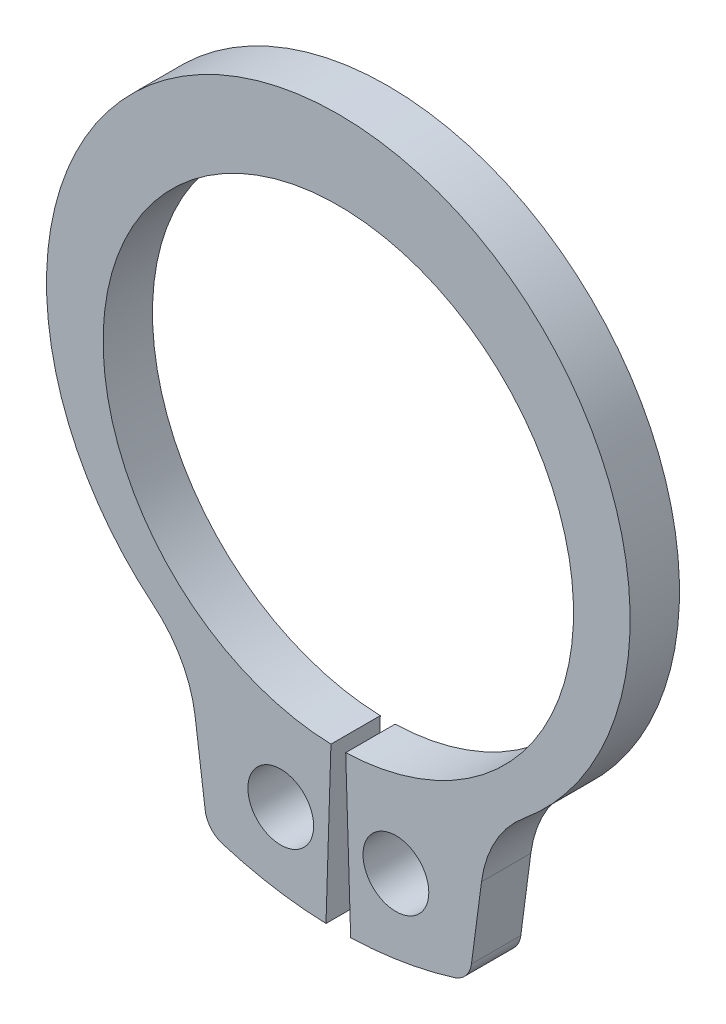
ISO-10303-21;
HEADER;
FILE_DESCRIPTION(('STEP AP214'),'2;1');
FILE_NAME('part.step','',(''),(''),'','','');
FILE_SCHEMA(('AUTOMOTIVE_DESIGN { 1 0 10303 214 1 1 1 1 }'));
ENDSEC;
DATA;
#1=APPLICATION_CONTEXT('core data for automotive mechanical design processes');
#2=APPLICATION_PROTOCOL_DEFINITION('international standard','automotive_design',2000,#1);
#3=PRODUCT_CONTEXT('',#1,'mechanical');
#4=PRODUCT('Part','Part','',(#3));
#5=PRODUCT_RELATED_PRODUCT_CATEGORY('part','',(#4));
#6=PRODUCT_DEFINITION_FORMATION('','',#4);
#7=PRODUCT_DEFINITION_CONTEXT('part definition',#1,'design');
#8=PRODUCT_DEFINITION('design','',#6,#7);
#9=PRODUCT_DEFINITION_SHAPE('','',#8);
#10=(LENGTH_UNIT() NAMED_UNIT(*) SI_UNIT(.MILLI.,.METRE.));
#11=(NAMED_UNIT(*) PLANE_ANGLE_UNIT() SI_UNIT($,.RADIAN.));
#12=(NAMED_UNIT(*) SI_UNIT($,.STERADIAN.) SOLID_ANGLE_UNIT());
#13=UNCERTAINTY_MEASURE_WITH_UNIT(LENGTH_MEASURE(1.E-05),#10,'distance_accuracy_value','');
#14=(GEOMETRIC_REPRESENTATION_CONTEXT(3) GLOBAL_UNCERTAINTY_ASSIGNED_CONTEXT((#13)) GLOBAL_UNIT_ASSIGNED_CONTEXT((#10,
#11,#12)) REPRESENTATION_CONTEXT('',''));
#15=CARTESIAN_POINT('',(0.,0.,0.));
#16=DIRECTION('',(0.,0.,1.));
#17=DIRECTION('',(1.,0.,0.));
#18=AXIS2_PLACEMENT_3D('',#15,#16,#17);
#19=CARTESIAN_POINT('',(0.,0.,-1.5));
#20=DIRECTION('',(0.,0.,1.));
#21=DIRECTION('',(1.,0.,0.));
#22=AXIS2_PLACEMENT_3D('',#19,#20,#21);
#23=CYLINDRICAL_SURFACE('',#22,7.15000000000001);
#24=CARTESIAN_POINT('',(0.,0.,0.));
#25=DIRECTION('',(0.,0.,-1.));
#26=DIRECTION('',(1.,0.,0.));
#27=AXIS2_PLACEMENT_3D('',#24,#25,#26);
#28=CIRCLE('',#27,7.15000000000001);
#29=CARTESIAN_POINT('',(-0.224372384937239,-7.14647864566023,0.));
#30=VERTEX_POINT('',#29);
#31=CARTESIAN_POINT('',(0.224372384937239,-7.14647864566023,0.));
#32=VERTEX_POINT('',#31);
#33=EDGE_CURVE('E155',#30,#32,#28,.T.);
#34=ORIENTED_EDGE('',*,*,#33,.F.);
#35=DIRECTION('',(0.,0.,1.));
#36=VECTOR('',#35,1.);
#37=CARTESIAN_POINT('',(-0.224372384937239,-7.14647864566023,-1.5));
#38=LINE('',#37,#36);
#39=CARTESIAN_POINT('',(-0.224372384937239,-7.14647864566023,-1.5));
#40=VERTEX_POINT('',#39);
#41=EDGE_CURVE('E11',#40,#30,#38,.T.);
#42=ORIENTED_EDGE('',*,*,#41,.F.);
#43=CARTESIAN_POINT('',(0.,0.,-1.5));
#44=DIRECTION('',(0.,0.,-1.));
#45=DIRECTION('',(1.,0.,0.));
#46=AXIS2_PLACEMENT_3D('',#43,#44,#45);
#47=CIRCLE('',#46,7.15000000000001);
#48=CARTESIAN_POINT('',(0.224372384937239,-7.14647864566023,-1.5));
#49=VERTEX_POINT('',#48);
#50=EDGE_CURVE('E188',#40,#49,#47,.T.);
#51=ORIENTED_EDGE('',*,*,#50,.T.);
#52=DIRECTION('',(0.,0.,1.));
#53=VECTOR('',#52,1.);
#54=CARTESIAN_POINT('',(0.224372384937239,-7.14647864566023,-1.5));
#55=LINE('',#54,#53);
#56=EDGE_CURVE('E37',#49,#32,#55,.T.);
#57=ORIENTED_EDGE('',*,*,#56,.T.);
#58=EDGE_LOOP('',(#34,#42,#51,#57));
#59=FACE_BOUND('',#58,.T.);
#60=ADVANCED_FACE('F34',(#59),#23,.F.);
#61=CARTESIAN_POINT('',(-0.224372384937239,-7.14647864566023,-1.5));
#62=DIRECTION('',(0.999507502889542,-0.0313807531380752,0.));
#63=DIRECTION('',(0.0313807531380752,0.999507502889542,0.));
#64=AXIS2_PLACEMENT_3D('',#61,#62,#63);
#65=PLANE('',#64);
#66=DIRECTION('',(0.0313807531380752,0.999507502889542,0.));
#67=VECTOR('',#66,1.);
#68=CARTESIAN_POINT('',(-0.224372384937239,-7.14647864566023,0.));
#69=LINE('',#68,#67);
#70=CARTESIAN_POINT('',(-0.375,-11.94411465953,0.));
#71=VERTEX_POINT('',#70);
#72=EDGE_CURVE('E186',#71,#30,#69,.T.);
#73=ORIENTED_EDGE('',*,*,#72,.F.);
#74=DIRECTION('',(0.,0.,1.));
#75=VECTOR('',#74,1.);
#76=CARTESIAN_POINT('',(-0.375,-11.94411465953,-1.5));
#77=LINE('',#76,#75);
#78=CARTESIAN_POINT('',(-0.375,-11.94411465953,-1.5));
#79=VERTEX_POINT('',#78);
#80=EDGE_CURVE('E43',#79,#71,#77,.T.);
#81=ORIENTED_EDGE('',*,*,#80,.F.);
#82=DIRECTION('',(0.0313807531380752,0.999507502889542,0.));
#83=VECTOR('',#82,1.);
#84=CARTESIAN_POINT('',(-0.224372384937239,-7.14647864566023,-1.5));
#85=LINE('',#84,#83);
#86=EDGE_CURVE('E145',#79,#40,#85,.T.);
#87=ORIENTED_EDGE('',*,*,#86,.T.);
#88=ORIENTED_EDGE('',*,*,#41,.T.);
#89=EDGE_LOOP('',(#73,#81,#87,#88));
#90=FACE_BOUND('',#89,.T.);
#91=ADVANCED_FACE('F208',(#90),#65,.T.);
#92=CARTESIAN_POINT('',(0.,0.,-1.5));
#93=DIRECTION('',(0.,0.,1.));
#94=DIRECTION('',(1.,0.,0.));
#95=AXIS2_PLACEMENT_3D('',#92,#93,#94);
#96=CYLINDRICAL_SURFACE('',#95,11.95);
#97=CARTESIAN_POINT('',(0.,0.,0.));
#98=DIRECTION('',(0.,0.,1.));
#99=DIRECTION('',(1.,0.,0.));
#100=AXIS2_PLACEMENT_3D('',#97,#98,#99);
#101=CIRCLE('',#100,11.95);
#102=CARTESIAN_POINT('',(-3.52441051131401,-11.4184513200232,0.));
#103=VERTEX_POINT('',#102);
#104=EDGE_CURVE('E132',#103,#71,#101,.T.);
#105=ORIENTED_EDGE('',*,*,#104,.F.);
#106=DIRECTION('',(0.,0.,1.));
#107=VECTOR('',#106,1.);
#108=CARTESIAN_POINT('',(-3.52441051131401,-11.4184513200232,-1.5));
#109=LINE('',#108,#107);
#110=CARTESIAN_POINT('',(-3.52441051131401,-11.4184513200232,-1.5));
#111=VERTEX_POINT('',#110);
#112=EDGE_CURVE('E127',#111,#103,#109,.T.);
#113=ORIENTED_EDGE('',*,*,#112,.F.);
#114=CARTESIAN_POINT('',(0.,0.,-1.5));
#115=DIRECTION('',(0.,0.,1.));
#116=DIRECTION('',(1.,0.,0.));
#117=AXIS2_PLACEMENT_3D('',#114,#115,#116);
#118=CIRCLE('',#117,11.95);
#119=EDGE_CURVE('E130',#111,#79,#118,.T.);
#120=ORIENTED_EDGE('',*,*,#119,.T.);
#121=ORIENTED_EDGE('',*,*,#80,.T.);
#122=EDGE_LOOP('',(#105,#113,#120,#121));
#123=FACE_BOUND('',#122,.T.);
#124=ADVANCED_FACE('F129',(#123),#96,.T.);
#125=CARTESIAN_POINT('',(-3.30321319888844,-10.7018121158376,-1.5));
#126=DIRECTION('',(0.,0.,1.));
#127=DIRECTION('',(1.,0.,0.));
#128=AXIS2_PLACEMENT_3D('',#125,#126,#127);
#129=CYLINDRICAL_SURFACE('',#128,0.749999999999998);
#130=CARTESIAN_POINT('',(-3.30321319888844,-10.7018121158376,0.));
#131=DIRECTION('',(0.,0.,1.));
#132=DIRECTION('',(1.,0.,0.));
#133=AXIS2_PLACEMENT_3D('',#130,#131,#132);
#134=CIRCLE('',#133,0.749999999999998);
#135=CARTESIAN_POINT('',(-4.04679684491879,-10.7997067600027,0.));
#136=VERTEX_POINT('',#135);
#137=EDGE_CURVE('E183',#136,#103,#134,.T.);
#138=ORIENTED_EDGE('',*,*,#137,.F.);
#139=DIRECTION('',(0.,0.,1.));
#140=VECTOR('',#139,1.);
#141=CARTESIAN_POINT('',(-4.04679684491879,-10.7997067600027,-1.5));
#142=LINE('',#141,#140);
#143=CARTESIAN_POINT('',(-4.04679684491879,-10.7997067600027,-1.5));
#144=VERTEX_POINT('',#143);
#145=EDGE_CURVE('E137',#144,#136,#142,.T.);
#146=ORIENTED_EDGE('',*,*,#145,.F.);
#147=CARTESIAN_POINT('',(-3.30321319888844,-10.7018121158376,-1.5));
#148=DIRECTION('',(0.,0.,1.));
#149=DIRECTION('',(1.,0.,0.));
#150=AXIS2_PLACEMENT_3D('',#147,#148,#149);
#151=CIRCLE('',#150,0.749999999999998);
#152=EDGE_CURVE('E143',#144,#111,#151,.T.);
#153=ORIENTED_EDGE('',*,*,#152,.T.);
#154=ORIENTED_EDGE('',*,*,#112,.T.);
#155=EDGE_LOOP('',(#138,#146,#153,#154));
#156=FACE_BOUND('',#155,.T.);
#157=ADVANCED_FACE('F147',(#156),#129,.T.);
#158=CARTESIAN_POINT('',(-4.35208395412913,-8.48082094465635,-1.5));
#159=DIRECTION('',(-0.99144486137381,-0.130526192220055,0.));
#160=DIRECTION('',(0.130526192220055,-0.99144486137381,0.));
#161=AXIS2_PLACEMENT_3D('',#158,#159,#160);
#162=PLANE('',#161);
#163=DIRECTION('',(0.130526192220055,-0.99144486137381,0.));
#164=VECTOR('',#163,1.);
#165=CARTESIAN_POINT('',(-4.35208395412913,-8.48082094465635,0.));
#166=LINE('',#165,#164);
#167=CARTESIAN_POINT('',(-4.35208395412913,-8.48082094465635,0.));
#168=VERTEX_POINT('',#167);
#169=EDGE_CURVE('E180',#168,#136,#166,.T.);
#170=ORIENTED_EDGE('',*,*,#169,.F.);
#171=DIRECTION('',(0.,0.,1.));
#172=VECTOR('',#171,1.);
#173=CARTESIAN_POINT('',(-4.35208395412913,-8.48082094465635,-1.5));
#174=LINE('',#173,#172);
#175=CARTESIAN_POINT('',(-4.35208395412913,-8.48082094465635,-1.5));
#176=VERTEX_POINT('',#175);
#177=EDGE_CURVE('E192',#176,#168,#174,.T.);
#178=ORIENTED_EDGE('',*,*,#177,.F.);
#179=DIRECTION('',(0.130526192220055,-0.99144486137381,0.));
#180=VECTOR('',#179,1.);
#181=CARTESIAN_POINT('',(-4.35208395412913,-8.48082094465635,-1.5));
#182=LINE('',#181,#180);
#183=EDGE_CURVE('E148',#176,#144,#182,.T.);
#184=ORIENTED_EDGE('',*,*,#183,.T.);
#185=ORIENTED_EDGE('',*,*,#145,.T.);
#186=EDGE_LOOP('',(#170,#178,#184,#185));
#187=FACE_BOUND('',#186,.T.);
#188=ADVANCED_FACE('F221',(#187),#162,.T.);
#189=CARTESIAN_POINT('',(-7.91801185207422,-8.95028425863739,-1.5));
#190=DIRECTION('',(0.,0.,1.));
#191=DIRECTION('',(1.,0.,0.));
#192=AXIS2_PLACEMENT_3D('',#189,#190,#191);
#193=CYLINDRICAL_SURFACE('',#192,3.59669814920812);
#194=CARTESIAN_POINT('',(-7.91801185207422,-8.95028425863739,0.));
#195=DIRECTION('',(0.,0.,-1.));
#196=DIRECTION('',(1.,0.,0.));
#197=AXIS2_PLACEMENT_3D('',#194,#195,#196);
#198=CIRCLE('',#197,3.59669814920812);
#199=CARTESIAN_POINT('',(-5.63370766568188,-6.17212084361883,0.));
#200=VERTEX_POINT('',#199);
#201=EDGE_CURVE('E177',#200,#168,#198,.T.);
#202=ORIENTED_EDGE('',*,*,#201,.F.);
#203=DIRECTION('',(0.,0.,1.));
#204=VECTOR('',#203,1.);
#205=CARTESIAN_POINT('',(-5.63370766568188,-6.17212084361883,-1.5));
#206=LINE('',#205,#204);
#207=CARTESIAN_POINT('',(-5.63370766568188,-6.17212084361883,-1.5));
#208=VERTEX_POINT('',#207);
#209=EDGE_CURVE('E194',#208,#200,#206,.T.);
#210=ORIENTED_EDGE('',*,*,#209,.F.);
#211=CARTESIAN_POINT('',(-7.91801185207422,-8.95028425863739,-1.5));
#212=DIRECTION('',(0.,0.,-1.));
#213=DIRECTION('',(1.,0.,0.));
#214=AXIS2_PLACEMENT_3D('',#211,#212,#213);
#215=CIRCLE('',#214,3.59669814920812);
#216=EDGE_CURVE('E150',#208,#176,#215,.T.);
#217=ORIENTED_EDGE('',*,*,#216,.T.);
#218=ORIENTED_EDGE('',*,*,#177,.T.);
#219=EDGE_LOOP('',(#202,#210,#217,#218));
#220=FACE_BOUND('',#219,.T.);
#221=ADVANCED_FACE('F224',(#220),#193,.F.);
#222=CARTESIAN_POINT('',(0.,0.679576325673524,-1.5));
#223=DIRECTION('',(0.,0.,1.));
#224=DIRECTION('',(1.,0.,0.));
#225=AXIS2_PLACEMENT_3D('',#222,#223,#224);
#226=CYLINDRICAL_SURFACE('',#225,8.87042367432648);
#227=CARTESIAN_POINT('',(0.,0.679576325673524,0.));
#228=DIRECTION('',(0.,0.,1.));
#229=DIRECTION('',(1.,0.,0.));
#230=AXIS2_PLACEMENT_3D('',#227,#228,#229);
#231=CIRCLE('',#230,8.87042367432648);
#232=CARTESIAN_POINT('',(5.63370766568188,-6.17212084361883,0.));
#233=VERTEX_POINT('',#232);
#234=EDGE_CURVE('E174',#233,#200,#231,.T.);
#235=ORIENTED_EDGE('',*,*,#234,.F.);
#236=DIRECTION('',(0.,0.,1.));
#237=VECTOR('',#236,1.);
#238=CARTESIAN_POINT('',(5.63370766568188,-6.17212084361883,-1.5));
#239=LINE('',#238,#237);
#240=CARTESIAN_POINT('',(5.63370766568188,-6.17212084361883,-1.5));
#241=VERTEX_POINT('',#240);
#242=EDGE_CURVE('E196',#241,#233,#239,.T.);
#243=ORIENTED_EDGE('',*,*,#242,.F.);
#244=CARTESIAN_POINT('',(0.,0.679576325673524,-1.5));
#245=DIRECTION('',(0.,0.,1.));
#246=DIRECTION('',(1.,0.,0.));
#247=AXIS2_PLACEMENT_3D('',#244,#245,#246);
#248=CIRCLE('',#247,8.87042367432648);
#249=EDGE_CURVE('E298',#241,#208,#248,.T.);
#250=ORIENTED_EDGE('',*,*,#249,.T.);
#251=ORIENTED_EDGE('',*,*,#209,.T.);
#252=EDGE_LOOP('',(#235,#243,#250,#251));
#253=FACE_BOUND('',#252,.T.);
#254=ADVANCED_FACE('F228',(#253),#226,.T.);
#255=CARTESIAN_POINT('',(7.91801185207422,-8.95028425863739,-1.5));
#256=DIRECTION('',(0.,0.,1.));
#257=DIRECTION('',(1.,0.,0.));
#258=AXIS2_PLACEMENT_3D('',#255,#256,#257);
#259=CYLINDRICAL_SURFACE('',#258,3.59669814920812);
#260=CARTESIAN_POINT('',(7.91801185207422,-8.95028425863739,0.));
#261=DIRECTION('',(0.,0.,-1.));
#262=DIRECTION('',(1.,0.,0.));
#263=AXIS2_PLACEMENT_3D('',#260,#261,#262);
#264=CIRCLE('',#263,3.59669814920812);
#265=CARTESIAN_POINT('',(4.35208395412913,-8.48082094465635,0.));
#266=VERTEX_POINT('',#265);
#267=EDGE_CURVE('E171',#266,#233,#264,.T.);
#268=ORIENTED_EDGE('',*,*,#267,.F.);
#269=DIRECTION('',(0.,0.,1.));
#270=VECTOR('',#269,1.);
#271=CARTESIAN_POINT('',(4.35208395412913,-8.48082094465635,-1.5));
#272=LINE('',#271,#270);
#273=CARTESIAN_POINT('',(4.35208395412913,-8.48082094465635,-1.5));
#274=VERTEX_POINT('',#273);
#275=EDGE_CURVE('E198',#274,#266,#272,.T.);
#276=ORIENTED_EDGE('',*,*,#275,.F.);
#277=CARTESIAN_POINT('',(7.91801185207422,-8.95028425863739,-1.5));
#278=DIRECTION('',(0.,0.,-1.));
#279=DIRECTION('',(1.,0.,0.));
#280=AXIS2_PLACEMENT_3D('',#277,#278,#279);
#281=CIRCLE('',#280,3.59669814920812);
#282=EDGE_CURVE('E295',#274,#241,#281,.T.);
#283=ORIENTED_EDGE('',*,*,#282,.T.);
#284=ORIENTED_EDGE('',*,*,#242,.T.);
#285=EDGE_LOOP('',(#268,#276,#283,#284));
#286=FACE_BOUND('',#285,.T.);
#287=ADVANCED_FACE('F232',(#286),#259,.F.);
#288=CARTESIAN_POINT('',(4.35208395412913,-8.48082094465635,-1.5));
#289=DIRECTION('',(0.99144486137381,-0.130526192220055,0.));
#290=DIRECTION('',(0.130526192220055,0.99144486137381,0.));
#291=AXIS2_PLACEMENT_3D('',#288,#289,#290);
#292=PLANE('',#291);
#293=DIRECTION('',(0.130526192220055,0.99144486137381,0.));
#294=VECTOR('',#293,1.);
#295=CARTESIAN_POINT('',(4.35208395412913,-8.48082094465635,0.));
#296=LINE('',#295,#294);
#297=CARTESIAN_POINT('',(4.04679684491879,-10.7997067600027,0.));
#298=VERTEX_POINT('',#297);
#299=EDGE_CURVE('E168',#298,#266,#296,.T.);
#300=ORIENTED_EDGE('',*,*,#299,.F.);
#301=DIRECTION('',(0.,0.,1.));
#302=VECTOR('',#301,1.);
#303=CARTESIAN_POINT('',(4.04679684491879,-10.7997067600027,-1.5));
#304=LINE('',#303,#302);
#305=CARTESIAN_POINT('',(4.04679684491879,-10.7997067600027,-1.5));
#306=VERTEX_POINT('',#305);
#307=EDGE_CURVE('E200',#306,#298,#304,.T.);
#308=ORIENTED_EDGE('',*,*,#307,.F.);
#309=DIRECTION('',(0.130526192220055,0.99144486137381,0.));
#310=VECTOR('',#309,1.);
#311=CARTESIAN_POINT('',(4.35208395412913,-8.48082094465635,-1.5));
#312=LINE('',#311,#310);
#313=EDGE_CURVE('E292',#306,#274,#312,.T.);
#314=ORIENTED_EDGE('',*,*,#313,.T.);
#315=ORIENTED_EDGE('',*,*,#275,.T.);
#316=EDGE_LOOP('',(#300,#308,#314,#315));
#317=FACE_BOUND('',#316,.T.);
#318=ADVANCED_FACE('F236',(#317),#292,.T.);
#319=CARTESIAN_POINT('',(3.30321319888844,-10.7018121158376,-1.5));
#320=DIRECTION('',(0.,0.,1.));
#321=DIRECTION('',(1.,0.,0.));
#322=AXIS2_PLACEMENT_3D('',#319,#320,#321);
#323=CYLINDRICAL_SURFACE('',#322,0.749999999999998);
#324=CARTESIAN_POINT('',(3.30321319888844,-10.7018121158376,0.));
#325=DIRECTION('',(0.,0.,1.));
#326=DIRECTION('',(-1.,0.,0.));
#327=AXIS2_PLACEMENT_3D('',#324,#325,#326);
#328=CIRCLE('',#327,0.749999999999998);
#329=CARTESIAN_POINT('',(3.524410511314,-11.4184513200232,0.));
#330=VERTEX_POINT('',#329);
#331=EDGE_CURVE('E165',#330,#298,#328,.T.);
#332=ORIENTED_EDGE('',*,*,#331,.F.);
#333=DIRECTION('',(0.,0.,1.));
#334=VECTOR('',#333,1.);
#335=CARTESIAN_POINT('',(3.524410511314,-11.4184513200232,-1.5));
#336=LINE('',#335,#334);
#337=CARTESIAN_POINT('',(3.524410511314,-11.4184513200232,-1.5));
#338=VERTEX_POINT('',#337);
#339=EDGE_CURVE('E202',#338,#330,#336,.T.);
#340=ORIENTED_EDGE('',*,*,#339,.F.);
#341=CARTESIAN_POINT('',(3.30321319888844,-10.7018121158376,-1.5));
#342=DIRECTION('',(0.,0.,1.));
#343=DIRECTION('',(-1.,0.,0.));
#344=AXIS2_PLACEMENT_3D('',#341,#342,#343);
#345=CIRCLE('',#344,0.749999999999998);
#346=EDGE_CURVE('E289',#338,#306,#345,.T.);
#347=ORIENTED_EDGE('',*,*,#346,.T.);
#348=ORIENTED_EDGE('',*,*,#307,.T.);
#349=EDGE_LOOP('',(#332,#340,#347,#348));
#350=FACE_BOUND('',#349,.T.);
#351=ADVANCED_FACE('F240',(#350),#323,.T.);
#352=CARTESIAN_POINT('',(0.,0.,-1.5));
#353=DIRECTION('',(0.,0.,1.));
#354=DIRECTION('',(1.,0.,0.));
#355=AXIS2_PLACEMENT_3D('',#352,#353,#354);
#356=CYLINDRICAL_SURFACE('',#355,11.95);
#357=CARTESIAN_POINT('',(0.,0.,0.));
#358=DIRECTION('',(0.,0.,1.));
#359=DIRECTION('',(1.,0.,0.));
#360=AXIS2_PLACEMENT_3D('',#357,#358,#359);
#361=CIRCLE('',#360,11.95);
#362=CARTESIAN_POINT('',(0.374999999999998,-11.94411465953,0.));
#363=VERTEX_POINT('',#362);
#364=EDGE_CURVE('E162',#363,#330,#361,.T.);
#365=ORIENTED_EDGE('',*,*,#364,.F.);
#366=DIRECTION('',(0.,0.,1.));
#367=VECTOR('',#366,1.);
#368=CARTESIAN_POINT('',(0.374999999999998,-11.94411465953,-1.5));
#369=LINE('',#368,#367);
#370=CARTESIAN_POINT('',(0.374999999999998,-11.94411465953,-1.5));
#371=VERTEX_POINT('',#370);
#372=EDGE_CURVE('E203',#371,#363,#369,.T.);
#373=ORIENTED_EDGE('',*,*,#372,.F.);
#374=CARTESIAN_POINT('',(0.,0.,-1.5));
#375=DIRECTION('',(0.,0.,1.));
#376=DIRECTION('',(1.,0.,0.));
#377=AXIS2_PLACEMENT_3D('',#374,#375,#376);
#378=CIRCLE('',#377,11.95);
#379=EDGE_CURVE('E286',#371,#338,#378,.T.);
#380=ORIENTED_EDGE('',*,*,#379,.T.);
#381=ORIENTED_EDGE('',*,*,#339,.T.);
#382=EDGE_LOOP('',(#365,#373,#380,#381));
#383=FACE_BOUND('',#382,.T.);
#384=ADVANCED_FACE('F244',(#383),#356,.T.);
#385=CARTESIAN_POINT('',(0.224372384937239,-7.14647864566023,-1.5));
#386=DIRECTION('',(-0.999507502889542,-0.0313807531380752,0.));
#387=DIRECTION('',(0.0313807531380752,-0.999507502889542,0.));
#388=AXIS2_PLACEMENT_3D('',#385,#386,#387);
#389=PLANE('',#388);
#390=DIRECTION('',(0.0313807531380752,-0.999507502889542,0.));
#391=VECTOR('',#390,1.);
#392=CARTESIAN_POINT('',(0.224372384937239,-7.14647864566023,0.));
#393=LINE('',#392,#391);
#394=EDGE_CURVE('E158',#32,#363,#393,.T.);
#395=ORIENTED_EDGE('',*,*,#394,.F.);
#396=ORIENTED_EDGE('',*,*,#56,.F.);
#397=DIRECTION('',(0.0313807531380752,-0.999507502889542,0.));
#398=VECTOR('',#397,1.);
#399=CARTESIAN_POINT('',(0.224372384937239,-7.14647864566023,-1.5));
#400=LINE('',#399,#398);
#401=EDGE_CURVE('E284',#49,#371,#400,.T.);
#402=ORIENTED_EDGE('',*,*,#401,.T.);
#403=ORIENTED_EDGE('',*,*,#372,.T.);
#404=EDGE_LOOP('',(#395,#396,#402,#403));
#405=FACE_BOUND('',#404,.T.);
#406=ADVANCED_FACE('F205',(#405),#389,.T.);
#407=CARTESIAN_POINT('',(0.,0.,-1.5));
#408=DIRECTION('',(0.,0.,1.));
#409=DIRECTION('',(1.,0.,0.));
#410=AXIS2_PLACEMENT_3D('',#407,#408,#409);
#411=PLANE('',#410);
#412=CARTESIAN_POINT('',(-1.75,-9.56624926499409,-1.5));
#413=DIRECTION('',(0.,0.,1.));
#414=DIRECTION('',(1.,0.,0.));
#415=AXIS2_PLACEMENT_3D('',#412,#413,#414);
#416=CIRCLE('',#415,1.);
#417=CARTESIAN_POINT('',(-0.75,-9.56624926499409,-1.5));
#418=VERTEX_POINT('',#417);
#419=EDGE_CURVE('E271',#418,#418,#416,.T.);
#420=ORIENTED_EDGE('',*,*,#419,.T.);
#421=EDGE_LOOP('',(#420));
#422=FACE_BOUND('',#421,.T.);
#423=CARTESIAN_POINT('',(1.75,-9.56624926499409,-1.5));
#424=DIRECTION('',(0.,0.,1.));
#425=DIRECTION('',(1.,0.,0.));
#426=AXIS2_PLACEMENT_3D('',#423,#424,#425);
#427=CIRCLE('',#426,1.);
#428=CARTESIAN_POINT('',(2.75,-9.56624926499409,-1.5));
#429=VERTEX_POINT('',#428);
#430=EDGE_CURVE('E159',#429,#429,#427,.T.);
#431=ORIENTED_EDGE('',*,*,#430,.T.);
#432=EDGE_LOOP('',(#431));
#433=FACE_BOUND('',#432,.T.);
#434=ORIENTED_EDGE('',*,*,#50,.F.);
#435=ORIENTED_EDGE('',*,*,#86,.F.);
#436=ORIENTED_EDGE('',*,*,#119,.F.);
#437=ORIENTED_EDGE('',*,*,#152,.F.);
#438=ORIENTED_EDGE('',*,*,#183,.F.);
#439=ORIENTED_EDGE('',*,*,#216,.F.);
#440=ORIENTED_EDGE('',*,*,#249,.F.);
#441=ORIENTED_EDGE('',*,*,#282,.F.);
#442=ORIENTED_EDGE('',*,*,#313,.F.);
#443=ORIENTED_EDGE('',*,*,#346,.F.);
#444=ORIENTED_EDGE('',*,*,#379,.F.);
#445=ORIENTED_EDGE('',*,*,#401,.F.);
#446=EDGE_LOOP('',(#434,#435,#436,#437,#438,#439,#440,#441,#442,#443,#444,#445));
#447=FACE_BOUND('',#446,.T.);
#448=ADVANCED_FACE('F141',(#422,#433,#447),#411,.F.);
#449=CARTESIAN_POINT('',(0.,0.,0.));
#450=DIRECTION('',(0.,0.,1.));
#451=DIRECTION('',(1.,0.,0.));
#452=AXIS2_PLACEMENT_3D('',#449,#450,#451);
#453=PLANE('',#452);
#454=CARTESIAN_POINT('',(-1.75,-9.56624926499409,0.));
#455=DIRECTION('',(0.,0.,1.));
#456=DIRECTION('',(1.,0.,0.));
#457=AXIS2_PLACEMENT_3D('',#454,#455,#456);
#458=CIRCLE('',#457,1.);
#459=CARTESIAN_POINT('',(-0.75,-9.56624926499409,0.));
#460=VERTEX_POINT('',#459);
#461=EDGE_CURVE('E274',#460,#460,#458,.T.);
#462=ORIENTED_EDGE('',*,*,#461,.F.);
#463=EDGE_LOOP('',(#462));
#464=FACE_BOUND('',#463,.T.);
#465=CARTESIAN_POINT('',(1.75,-9.56624926499409,0.));
#466=DIRECTION('',(0.,0.,1.));
#467=DIRECTION('',(1.,0.,0.));
#468=AXIS2_PLACEMENT_3D('',#465,#466,#467);
#469=CIRCLE('',#468,1.);
#470=CARTESIAN_POINT('',(2.75,-9.56624926499409,0.));
#471=VERTEX_POINT('',#470);
#472=EDGE_CURVE('E276',#471,#471,#469,.T.);
#473=ORIENTED_EDGE('',*,*,#472,.F.);
#474=EDGE_LOOP('',(#473));
#475=FACE_BOUND('',#474,.T.);
#476=ORIENTED_EDGE('',*,*,#33,.T.);
#477=ORIENTED_EDGE('',*,*,#394,.T.);
#478=ORIENTED_EDGE('',*,*,#364,.T.);
#479=ORIENTED_EDGE('',*,*,#331,.T.);
#480=ORIENTED_EDGE('',*,*,#299,.T.);
#481=ORIENTED_EDGE('',*,*,#267,.T.);
#482=ORIENTED_EDGE('',*,*,#234,.T.);
#483=ORIENTED_EDGE('',*,*,#201,.T.);
#484=ORIENTED_EDGE('',*,*,#169,.T.);
#485=ORIENTED_EDGE('',*,*,#137,.T.);
#486=ORIENTED_EDGE('',*,*,#104,.T.);
#487=ORIENTED_EDGE('',*,*,#72,.T.);
#488=EDGE_LOOP('',(#476,#477,#478,#479,#480,#481,#482,#483,#484,#485,#486,#487));
#489=FACE_BOUND('',#488,.T.);
#490=ADVANCED_FACE('F207',(#464,#475,#489),#453,.T.);
#491=CARTESIAN_POINT('',(1.75,-9.56624926499409,-1.5));
#492=DIRECTION('',(0.,0.,1.));
#493=DIRECTION('',(1.,0.,0.));
#494=AXIS2_PLACEMENT_3D('',#491,#492,#493);
#495=CYLINDRICAL_SURFACE('',#494,1.);
#496=ORIENTED_EDGE('',*,*,#430,.F.);
#497=EDGE_LOOP('',(#496));
#498=FACE_BOUND('',#497,.T.);
#499=ORIENTED_EDGE('',*,*,#472,.T.);
#500=EDGE_LOOP('',(#499));
#501=FACE_BOUND('',#500,.T.);
#502=ADVANCED_FACE('F256',(#498,#501),#495,.F.);
#503=CARTESIAN_POINT('',(-1.75,-9.56624926499409,-1.5));
#504=DIRECTION('',(0.,0.,1.));
#505=DIRECTION('',(1.,0.,0.));
#506=AXIS2_PLACEMENT_3D('',#503,#504,#505);
#507=CYLINDRICAL_SURFACE('',#506,1.);
#508=ORIENTED_EDGE('',*,*,#419,.F.);
#509=EDGE_LOOP('',(#508));
#510=FACE_BOUND('',#509,.T.);
#511=ORIENTED_EDGE('',*,*,#461,.T.);
#512=EDGE_LOOP('',(#511));
#513=FACE_BOUND('',#512,.T.);
#514=ADVANCED_FACE('F263',(#510,#513),#507,.F.);
#515=CLOSED_SHELL('',(#60,#91,#124,#157,#188,#221,#254,#287,#318,#351,#384,#406,#448,#490,#502,#514));
#516=MANIFOLD_SOLID_BREP('B2',#515);
#517=ADVANCED_BREP_SHAPE_REPRESENTATION('',(#18,#516),#14);
#518=SHAPE_DEFINITION_REPRESENTATION(#9,#517);
ENDSEC;
END-ISO-10303-21;
